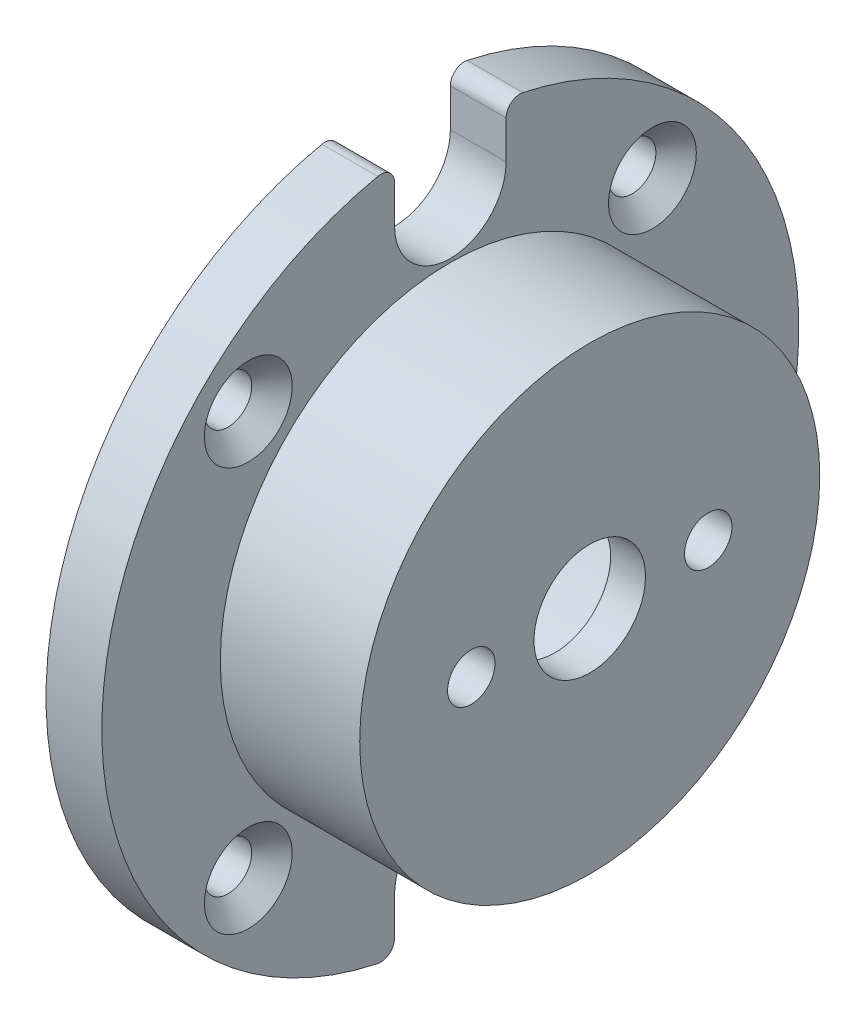
ISO-10303-21;
HEADER;
FILE_DESCRIPTION(('STEP AP214'),'2;1');
FILE_NAME('part.step','',(''),(''),'','','');
FILE_SCHEMA(('AUTOMOTIVE_DESIGN { 1 0 10303 214 1 1 1 1 }'));
ENDSEC;
DATA;
#1=APPLICATION_CONTEXT('core data for automotive mechanical design processes');
#2=APPLICATION_PROTOCOL_DEFINITION('international standard','automotive_design',2000,#1);
#3=PRODUCT_CONTEXT('',#1,'mechanical');
#4=PRODUCT('Part','Part','',(#3));
#5=PRODUCT_RELATED_PRODUCT_CATEGORY('part','',(#4));
#6=PRODUCT_DEFINITION_FORMATION('','',#4);
#7=PRODUCT_DEFINITION_CONTEXT('part definition',#1,'design');
#8=PRODUCT_DEFINITION('design','',#6,#7);
#9=PRODUCT_DEFINITION_SHAPE('','',#8);
#10=(LENGTH_UNIT() NAMED_UNIT(*) SI_UNIT(.MILLI.,.METRE.));
#11=(NAMED_UNIT(*) PLANE_ANGLE_UNIT() SI_UNIT($,.RADIAN.));
#12=(NAMED_UNIT(*) SI_UNIT($,.STERADIAN.) SOLID_ANGLE_UNIT());
#13=UNCERTAINTY_MEASURE_WITH_UNIT(LENGTH_MEASURE(1.E-05),#10,'distance_accuracy_value','');
#14=(GEOMETRIC_REPRESENTATION_CONTEXT(3) GLOBAL_UNCERTAINTY_ASSIGNED_CONTEXT((#13)) GLOBAL_UNIT_ASSIGNED_CONTEXT((#10,
#11,#12)) REPRESENTATION_CONTEXT('',''));
#15=CARTESIAN_POINT('',(0.,0.,0.));
#16=DIRECTION('',(0.,0.,1.));
#17=DIRECTION('',(1.,0.,0.));
#18=AXIS2_PLACEMENT_3D('',#15,#16,#17);
#19=CARTESIAN_POINT('',(4.,0.,0.));
#20=DIRECTION('',(-1.,0.,0.));
#21=DIRECTION('',(0.,0.,1.));
#22=AXIS2_PLACEMENT_3D('',#19,#20,#21);
#23=CYLINDRICAL_SURFACE('',#22,25.);
#24=DIRECTION('',(1.,0.,0.));
#25=VECTOR('',#24,1.);
#26=CARTESIAN_POINT('',(-6.,-24.4514470714698,-5.20833333333333));
#27=LINE('',#26,#25);
#28=CARTESIAN_POINT('',(0.,-24.4514470714698,-5.20833333333333));
#29=VERTEX_POINT('',#28);
#30=CARTESIAN_POINT('',(4.,-24.4514470714698,-5.20833333333333));
#31=VERTEX_POINT('',#30);
#32=EDGE_CURVE('E146',#29,#31,#27,.T.);
#33=ORIENTED_EDGE('',*,*,#32,.F.);
#34=CARTESIAN_POINT('',(0.,0.,0.));
#35=DIRECTION('',(1.,0.,0.));
#36=DIRECTION('',(0.,0.,-1.));
#37=AXIS2_PLACEMENT_3D('',#34,#35,#36);
#38=CIRCLE('',#37,25.);
#39=CARTESIAN_POINT('',(0.,24.4514470714698,-5.20833333333334));
#40=VERTEX_POINT('',#39);
#41=EDGE_CURVE('E165',#29,#40,#38,.T.);
#42=ORIENTED_EDGE('',*,*,#41,.T.);
#43=DIRECTION('',(1.,0.,0.));
#44=VECTOR('',#43,1.);
#45=CARTESIAN_POINT('',(-6.,24.4514470714698,-5.20833333333334));
#46=LINE('',#45,#44);
#47=CARTESIAN_POINT('',(4.,24.4514470714698,-5.20833333333334));
#48=VERTEX_POINT('',#47);
#49=EDGE_CURVE('E231',#40,#48,#46,.T.);
#50=ORIENTED_EDGE('',*,*,#49,.T.);
#51=CARTESIAN_POINT('',(4.,0.,0.));
#52=DIRECTION('',(1.,0.,0.));
#53=DIRECTION('',(0.,0.,-1.));
#54=AXIS2_PLACEMENT_3D('',#51,#52,#53);
#55=CIRCLE('',#54,25.);
#56=EDGE_CURVE('E155',#31,#48,#55,.T.);
#57=ORIENTED_EDGE('',*,*,#56,.F.);
#58=EDGE_LOOP('',(#33,#42,#50,#57));
#59=FACE_BOUND('',#58,.T.);
#60=ADVANCED_FACE('F39',(#59),#23,.T.);
#61=CARTESIAN_POINT('',(4.,0.,0.));
#62=DIRECTION('',(1.,0.,0.));
#63=DIRECTION('',(0.,0.,-1.));
#64=AXIS2_PLACEMENT_3D('',#61,#62,#63);
#65=PLANE('',#64);
#66=CARTESIAN_POINT('',(4.,-23.473389188611,5.));
#67=DIRECTION('',(-1.,0.,0.));
#68=DIRECTION('',(0.,0.,1.));
#69=AXIS2_PLACEMENT_3D('',#66,#67,#68);
#70=CIRCLE('',#69,1.);
#71=CARTESIAN_POINT('',(4.,-23.473389188611,4.));
#72=VERTEX_POINT('',#71);
#73=CARTESIAN_POINT('',(4.,-24.4514470714698,5.20833333333333));
#74=VERTEX_POINT('',#73);
#75=EDGE_CURVE('E127',#72,#74,#70,.T.);
#76=ORIENTED_EDGE('',*,*,#75,.F.);
#77=DIRECTION('',(0.,-1.,0.));
#78=VECTOR('',#77,1.);
#79=CARTESIAN_POINT('',(4.,-20.75,4.));
#80=LINE('',#79,#78);
#81=CARTESIAN_POINT('',(4.,-20.75,4.));
#82=VERTEX_POINT('',#81);
#83=EDGE_CURVE('E147',#82,#72,#80,.T.);
#84=ORIENTED_EDGE('',*,*,#83,.F.);
#85=CARTESIAN_POINT('',(4.,-20.75,0.));
#86=DIRECTION('',(1.,0.,0.));
#87=DIRECTION('',(0.,0.,1.));
#88=AXIS2_PLACEMENT_3D('',#85,#86,#87);
#89=CIRCLE('',#88,4.);
#90=CARTESIAN_POINT('',(4.,-20.75,-4.));
#91=VERTEX_POINT('',#90);
#92=EDGE_CURVE('E209',#91,#82,#89,.T.);
#93=ORIENTED_EDGE('',*,*,#92,.F.);
#94=DIRECTION('',(0.,1.,0.));
#95=VECTOR('',#94,1.);
#96=CARTESIAN_POINT('',(4.,-20.75,-4.));
#97=LINE('',#96,#95);
#98=CARTESIAN_POINT('',(4.,-23.473389188611,-4.));
#99=VERTEX_POINT('',#98);
#100=EDGE_CURVE('E560',#99,#91,#97,.T.);
#101=ORIENTED_EDGE('',*,*,#100,.F.);
#102=CARTESIAN_POINT('',(4.,-23.473389188611,-5.));
#103=DIRECTION('',(-1.,0.,0.));
#104=DIRECTION('',(0.,0.,-1.));
#105=AXIS2_PLACEMENT_3D('',#102,#103,#104);
#106=CIRCLE('',#105,1.);
#107=EDGE_CURVE('E137',#31,#99,#106,.T.);
#108=ORIENTED_EDGE('',*,*,#107,.F.);
#109=ORIENTED_EDGE('',*,*,#56,.T.);
#110=CARTESIAN_POINT('',(4.,23.473389188611,-5.));
#111=DIRECTION('',(-1.,0.,0.));
#112=DIRECTION('',(0.,0.,1.));
#113=AXIS2_PLACEMENT_3D('',#110,#111,#112);
#114=CIRCLE('',#113,1.);
#115=CARTESIAN_POINT('',(4.,23.473389188611,-4.));
#116=VERTEX_POINT('',#115);
#117=EDGE_CURVE('E212',#116,#48,#114,.T.);
#118=ORIENTED_EDGE('',*,*,#117,.F.);
#119=DIRECTION('',(0.,1.,0.));
#120=VECTOR('',#119,1.);
#121=CARTESIAN_POINT('',(4.,20.75,-4.));
#122=LINE('',#121,#120);
#123=CARTESIAN_POINT('',(4.,20.75,-4.));
#124=VERTEX_POINT('',#123);
#125=EDGE_CURVE('E228',#124,#116,#122,.T.);
#126=ORIENTED_EDGE('',*,*,#125,.F.);
#127=CARTESIAN_POINT('',(4.,20.75,0.));
#128=DIRECTION('',(1.,0.,0.));
#129=DIRECTION('',(0.,0.,-1.));
#130=AXIS2_PLACEMENT_3D('',#127,#128,#129);
#131=CIRCLE('',#130,4.);
#132=CARTESIAN_POINT('',(4.,20.75,4.));
#133=VERTEX_POINT('',#132);
#134=EDGE_CURVE('E225',#133,#124,#131,.T.);
#135=ORIENTED_EDGE('',*,*,#134,.F.);
#136=DIRECTION('',(0.,-1.,0.));
#137=VECTOR('',#136,1.);
#138=CARTESIAN_POINT('',(4.,20.75,4.));
#139=LINE('',#138,#137);
#140=CARTESIAN_POINT('',(4.,23.473389188611,4.));
#141=VERTEX_POINT('',#140);
#142=EDGE_CURVE('E222',#141,#133,#139,.T.);
#143=ORIENTED_EDGE('',*,*,#142,.F.);
#144=CARTESIAN_POINT('',(4.,23.473389188611,5.));
#145=DIRECTION('',(-1.,0.,0.));
#146=DIRECTION('',(0.,0.,-1.));
#147=AXIS2_PLACEMENT_3D('',#144,#145,#146);
#148=CIRCLE('',#147,1.);
#149=CARTESIAN_POINT('',(4.,24.4514470714698,5.20833333333333));
#150=VERTEX_POINT('',#149);
#151=EDGE_CURVE('E153',#150,#141,#148,.T.);
#152=ORIENTED_EDGE('',*,*,#151,.F.);
#153=EDGE_CURVE('E143',#150,#74,#55,.T.);
#154=ORIENTED_EDGE('',*,*,#153,.T.);
#155=EDGE_LOOP('',(#76,#84,#93,#101,#108,#109,#118,#126,#135,#143,#152,#154));
#156=FACE_BOUND('',#155,.T.);
#157=CARTESIAN_POINT('',(4.,14.4956890143241,14.4956890143244));
#158=DIRECTION('',(1.,0.,0.));
#159=DIRECTION('',(0.,0.,-1.));
#160=AXIS2_PLACEMENT_3D('',#157,#158,#159);
#161=CIRCLE('',#160,3.15);
#162=CARTESIAN_POINT('',(4.,14.4956890143241,11.3456890143244));
#163=VERTEX_POINT('',#162);
#164=EDGE_CURVE('E249',#163,#163,#161,.T.);
#165=ORIENTED_EDGE('',*,*,#164,.F.);
#166=EDGE_LOOP('',(#165));
#167=FACE_BOUND('',#166,.T.);
#168=CARTESIAN_POINT('',(4.,14.4956890143242,-14.4956890143242));
#169=DIRECTION('',(1.,0.,0.));
#170=DIRECTION('',(0.,0.,-1.));
#171=AXIS2_PLACEMENT_3D('',#168,#169,#170);
#172=CIRCLE('',#171,3.15);
#173=CARTESIAN_POINT('',(4.,14.4956890143242,-17.6456890143242));
#174=VERTEX_POINT('',#173);
#175=EDGE_CURVE('E258',#174,#174,#172,.T.);
#176=ORIENTED_EDGE('',*,*,#175,.F.);
#177=EDGE_LOOP('',(#176));
#178=FACE_BOUND('',#177,.T.);
#179=CARTESIAN_POINT('',(4.,-14.4956890143242,-14.4956890143243));
#180=DIRECTION('',(1.,0.,0.));
#181=DIRECTION('',(0.,0.,-1.));
#182=AXIS2_PLACEMENT_3D('',#179,#180,#181);
#183=CIRCLE('',#182,3.15);
#184=CARTESIAN_POINT('',(4.,-14.4956890143242,-17.6456890143243));
#185=VERTEX_POINT('',#184);
#186=EDGE_CURVE('E267',#185,#185,#183,.T.);
#187=ORIENTED_EDGE('',*,*,#186,.F.);
#188=EDGE_LOOP('',(#187));
#189=FACE_BOUND('',#188,.T.);
#190=CARTESIAN_POINT('',(4.,-14.4956890143242,14.4956890143242));
#191=DIRECTION('',(1.,0.,0.));
#192=DIRECTION('',(0.,0.,-1.));
#193=AXIS2_PLACEMENT_3D('',#190,#191,#192);
#194=CIRCLE('',#193,3.15);
#195=CARTESIAN_POINT('',(4.,-14.4956890143242,11.3456890143242));
#196=VERTEX_POINT('',#195);
#197=EDGE_CURVE('E276',#196,#196,#194,.T.);
#198=ORIENTED_EDGE('',*,*,#197,.F.);
#199=EDGE_LOOP('',(#198));
#200=FACE_BOUND('',#199,.T.);
#201=CARTESIAN_POINT('',(4.,0.,0.));
#202=DIRECTION('',(1.,0.,0.));
#203=DIRECTION('',(0.,0.,-1.));
#204=AXIS2_PLACEMENT_3D('',#201,#202,#203);
#205=CIRCLE('',#204,16.5);
#206=CARTESIAN_POINT('',(4.,0.,-16.5));
#207=VERTEX_POINT('',#206);
#208=EDGE_CURVE('E162',#207,#207,#205,.T.);
#209=ORIENTED_EDGE('',*,*,#208,.F.);
#210=EDGE_LOOP('',(#209));
#211=FACE_BOUND('',#210,.T.);
#212=ADVANCED_FACE('F150',(#156,#167,#178,#189,#200,#211),#65,.T.);
#213=CARTESIAN_POINT('',(0.,24.4514470714698,5.20833333333333));
#214=VERTEX_POINT('',#213);
#215=CARTESIAN_POINT('',(0.,-24.4514470714698,5.20833333333333));
#216=VERTEX_POINT('',#215);
#217=EDGE_CURVE('E145',#214,#216,#38,.T.);
#218=ORIENTED_EDGE('',*,*,#217,.T.);
#219=DIRECTION('',(1.,0.,0.));
#220=VECTOR('',#219,1.);
#221=CARTESIAN_POINT('',(-6.,-24.4514470714698,5.20833333333333));
#222=LINE('',#221,#220);
#223=EDGE_CURVE('E130',#216,#74,#222,.T.);
#224=ORIENTED_EDGE('',*,*,#223,.T.);
#225=ORIENTED_EDGE('',*,*,#153,.F.);
#226=DIRECTION('',(1.,0.,0.));
#227=VECTOR('',#226,1.);
#228=CARTESIAN_POINT('',(-6.,24.4514470714698,5.20833333333333));
#229=LINE('',#228,#227);
#230=EDGE_CURVE('E240',#214,#150,#229,.T.);
#231=ORIENTED_EDGE('',*,*,#230,.F.);
#232=EDGE_LOOP('',(#218,#224,#225,#231));
#233=FACE_BOUND('',#232,.T.);
#234=ADVANCED_FACE('F41',(#233),#23,.T.);
#235=CARTESIAN_POINT('',(0.,0.,0.));
#236=DIRECTION('',(1.,0.,0.));
#237=DIRECTION('',(0.,0.,-1.));
#238=AXIS2_PLACEMENT_3D('',#235,#236,#237);
#239=PLANE('',#238);
#240=CARTESIAN_POINT('',(0.,0.,0.));
#241=DIRECTION('',(-1.,0.,0.));
#242=DIRECTION('',(0.,0.,1.));
#243=AXIS2_PLACEMENT_3D('',#240,#241,#242);
#244=CIRCLE('',#243,13.125);
#245=CARTESIAN_POINT('',(0.,0.,13.125));
#246=VERTEX_POINT('',#245);
#247=EDGE_CURVE('E234',#246,#246,#244,.T.);
#248=ORIENTED_EDGE('',*,*,#247,.F.);
#249=EDGE_LOOP('',(#248));
#250=FACE_BOUND('',#249,.T.);
#251=CARTESIAN_POINT('',(0.,14.4956890143241,14.4956890143244));
#252=DIRECTION('',(1.,0.,0.));
#253=DIRECTION('',(0.,0.,-1.));
#254=AXIS2_PLACEMENT_3D('',#251,#252,#253);
#255=CIRCLE('',#254,1.7);
#256=CARTESIAN_POINT('',(0.,14.4956890143241,12.7956890143244));
#257=VERTEX_POINT('',#256);
#258=EDGE_CURVE('E255',#257,#257,#255,.T.);
#259=ORIENTED_EDGE('',*,*,#258,.T.);
#260=EDGE_LOOP('',(#259));
#261=FACE_BOUND('',#260,.T.);
#262=CARTESIAN_POINT('',(0.,14.4956890143242,-14.4956890143242));
#263=DIRECTION('',(1.,0.,0.));
#264=DIRECTION('',(0.,0.,-1.));
#265=AXIS2_PLACEMENT_3D('',#262,#263,#264);
#266=CIRCLE('',#265,1.7);
#267=CARTESIAN_POINT('',(0.,14.4956890143242,-16.1956890143242));
#268=VERTEX_POINT('',#267);
#269=EDGE_CURVE('E264',#268,#268,#266,.T.);
#270=ORIENTED_EDGE('',*,*,#269,.T.);
#271=EDGE_LOOP('',(#270));
#272=FACE_BOUND('',#271,.T.);
#273=CARTESIAN_POINT('',(0.,-14.4956890143242,-14.4956890143243));
#274=DIRECTION('',(1.,0.,0.));
#275=DIRECTION('',(0.,0.,-1.));
#276=AXIS2_PLACEMENT_3D('',#273,#274,#275);
#277=CIRCLE('',#276,1.7);
#278=CARTESIAN_POINT('',(0.,-14.4956890143242,-16.1956890143243));
#279=VERTEX_POINT('',#278);
#280=EDGE_CURVE('E273',#279,#279,#277,.T.);
#281=ORIENTED_EDGE('',*,*,#280,.T.);
#282=EDGE_LOOP('',(#281));
#283=FACE_BOUND('',#282,.T.);
#284=CARTESIAN_POINT('',(0.,-14.4956890143242,14.4956890143242));
#285=DIRECTION('',(1.,0.,0.));
#286=DIRECTION('',(0.,0.,-1.));
#287=AXIS2_PLACEMENT_3D('',#284,#285,#286);
#288=CIRCLE('',#287,1.7);
#289=CARTESIAN_POINT('',(0.,-14.4956890143242,12.7956890143242));
#290=VERTEX_POINT('',#289);
#291=EDGE_CURVE('E282',#290,#290,#288,.T.);
#292=ORIENTED_EDGE('',*,*,#291,.T.);
#293=EDGE_LOOP('',(#292));
#294=FACE_BOUND('',#293,.T.);
#295=DIRECTION('',(0.,-1.,0.));
#296=VECTOR('',#295,1.);
#297=CARTESIAN_POINT('',(0.,0.,4.));
#298=LINE('',#297,#296);
#299=CARTESIAN_POINT('',(0.,-20.75,4.));
#300=VERTEX_POINT('',#299);
#301=CARTESIAN_POINT('',(0.,-23.473389188611,4.));
#302=VERTEX_POINT('',#301);
#303=EDGE_CURVE('E47',#300,#302,#298,.T.);
#304=ORIENTED_EDGE('',*,*,#303,.T.);
#305=CARTESIAN_POINT('',(0.,-23.473389188611,5.));
#306=DIRECTION('',(1.,0.,0.));
#307=DIRECTION('',(0.,0.,-1.));
#308=AXIS2_PLACEMENT_3D('',#305,#306,#307);
#309=CIRCLE('',#308,1.);
#310=EDGE_CURVE('E12',#302,#216,#309,.F.);
#311=ORIENTED_EDGE('',*,*,#310,.T.);
#312=ORIENTED_EDGE('',*,*,#217,.F.);
#313=CARTESIAN_POINT('',(0.,23.473389188611,5.));
#314=DIRECTION('',(1.,0.,0.));
#315=DIRECTION('',(0.,0.,-1.));
#316=AXIS2_PLACEMENT_3D('',#313,#314,#315);
#317=CIRCLE('',#316,1.);
#318=CARTESIAN_POINT('',(0.,23.473389188611,4.));
#319=VERTEX_POINT('',#318);
#320=EDGE_CURVE('E154',#214,#319,#317,.F.);
#321=ORIENTED_EDGE('',*,*,#320,.T.);
#322=DIRECTION('',(0.,-1.,0.));
#323=VECTOR('',#322,1.);
#324=CARTESIAN_POINT('',(0.,0.,4.));
#325=LINE('',#324,#323);
#326=CARTESIAN_POINT('',(0.,20.75,4.));
#327=VERTEX_POINT('',#326);
#328=EDGE_CURVE('E158',#319,#327,#325,.T.);
#329=ORIENTED_EDGE('',*,*,#328,.T.);
#330=CARTESIAN_POINT('',(0.,20.75,0.));
#331=DIRECTION('',(1.,0.,0.));
#332=DIRECTION('',(0.,0.,-1.));
#333=AXIS2_PLACEMENT_3D('',#330,#331,#332);
#334=CIRCLE('',#333,4.);
#335=CARTESIAN_POINT('',(0.,20.75,-4.));
#336=VERTEX_POINT('',#335);
#337=EDGE_CURVE('E180',#327,#336,#334,.T.);
#338=ORIENTED_EDGE('',*,*,#337,.T.);
#339=DIRECTION('',(0.,1.,0.));
#340=VECTOR('',#339,1.);
#341=CARTESIAN_POINT('',(0.,0.,-4.));
#342=LINE('',#341,#340);
#343=CARTESIAN_POINT('',(0.,23.473389188611,-4.));
#344=VERTEX_POINT('',#343);
#345=EDGE_CURVE('E183',#336,#344,#342,.T.);
#346=ORIENTED_EDGE('',*,*,#345,.T.);
#347=CARTESIAN_POINT('',(0.,23.473389188611,-5.));
#348=DIRECTION('',(1.,0.,0.));
#349=DIRECTION('',(0.,0.,-1.));
#350=AXIS2_PLACEMENT_3D('',#347,#348,#349);
#351=CIRCLE('',#350,1.);
#352=EDGE_CURVE('E186',#344,#40,#351,.F.);
#353=ORIENTED_EDGE('',*,*,#352,.T.);
#354=ORIENTED_EDGE('',*,*,#41,.F.);
#355=CARTESIAN_POINT('',(0.,-23.473389188611,-5.));
#356=DIRECTION('',(1.,0.,0.));
#357=DIRECTION('',(0.,0.,-1.));
#358=AXIS2_PLACEMENT_3D('',#355,#356,#357);
#359=CIRCLE('',#358,1.);
#360=CARTESIAN_POINT('',(0.,-23.473389188611,-4.));
#361=VERTEX_POINT('',#360);
#362=EDGE_CURVE('E189',#29,#361,#359,.F.);
#363=ORIENTED_EDGE('',*,*,#362,.T.);
#364=DIRECTION('',(0.,1.,0.));
#365=VECTOR('',#364,1.);
#366=CARTESIAN_POINT('',(0.,0.,-4.));
#367=LINE('',#366,#365);
#368=CARTESIAN_POINT('',(0.,-20.75,-4.));
#369=VERTEX_POINT('',#368);
#370=EDGE_CURVE('E192',#361,#369,#367,.T.);
#371=ORIENTED_EDGE('',*,*,#370,.T.);
#372=CARTESIAN_POINT('',(0.,-20.75,0.));
#373=DIRECTION('',(1.,0.,0.));
#374=DIRECTION('',(0.,0.,-1.));
#375=AXIS2_PLACEMENT_3D('',#372,#373,#374);
#376=CIRCLE('',#375,4.);
#377=EDGE_CURVE('E195',#369,#300,#376,.T.);
#378=ORIENTED_EDGE('',*,*,#377,.T.);
#379=EDGE_LOOP('',(#304,#311,#312,#321,#329,#338,#346,#353,#354,#363,#371,#378));
#380=FACE_BOUND('',#379,.T.);
#381=ADVANCED_FACE('F199',(#250,#261,#272,#283,#294,#380),#239,.F.);
#382=CARTESIAN_POINT('',(14.,0.,0.));
#383=DIRECTION('',(-1.,0.,0.));
#384=DIRECTION('',(0.,0.,1.));
#385=AXIS2_PLACEMENT_3D('',#382,#383,#384);
#386=CYLINDRICAL_SURFACE('',#385,16.5);
#387=CARTESIAN_POINT('',(14.,0.,0.));
#388=DIRECTION('',(1.,0.,0.));
#389=DIRECTION('',(0.,0.,-1.));
#390=AXIS2_PLACEMENT_3D('',#387,#388,#389);
#391=CIRCLE('',#390,16.5);
#392=CARTESIAN_POINT('',(14.,0.,-16.5));
#393=VERTEX_POINT('',#392);
#394=EDGE_CURVE('E290',#393,#393,#391,.T.);
#395=ORIENTED_EDGE('',*,*,#394,.F.);
#396=EDGE_LOOP('',(#395));
#397=FACE_BOUND('',#396,.T.);
#398=ORIENTED_EDGE('',*,*,#208,.T.);
#399=EDGE_LOOP('',(#398));
#400=FACE_BOUND('',#399,.T.);
#401=ADVANCED_FACE('F297',(#397,#400),#386,.T.);
#402=CARTESIAN_POINT('',(14.,0.,0.));
#403=DIRECTION('',(1.,0.,0.));
#404=DIRECTION('',(0.,0.,-1.));
#405=AXIS2_PLACEMENT_3D('',#402,#403,#404);
#406=PLANE('',#405);
#407=CARTESIAN_POINT('',(14.,0.,-8.5));
#408=DIRECTION('',(1.,0.,0.));
#409=DIRECTION('',(0.,0.,-1.));
#410=AXIS2_PLACEMENT_3D('',#407,#408,#409);
#411=CIRCLE('',#410,1.69999999999999);
#412=CARTESIAN_POINT('',(14.,0.,-10.2));
#413=VERTEX_POINT('',#412);
#414=EDGE_CURVE('E176',#413,#413,#411,.T.);
#415=ORIENTED_EDGE('',*,*,#414,.F.);
#416=EDGE_LOOP('',(#415));
#417=FACE_BOUND('',#416,.T.);
#418=CARTESIAN_POINT('',(14.,0.,8.5));
#419=DIRECTION('',(1.,0.,0.));
#420=DIRECTION('',(0.,0.,-1.));
#421=AXIS2_PLACEMENT_3D('',#418,#419,#420);
#422=CIRCLE('',#421,1.69999999999999);
#423=CARTESIAN_POINT('',(14.,0.,6.80000000000001));
#424=VERTEX_POINT('',#423);
#425=EDGE_CURVE('E173',#424,#424,#422,.T.);
#426=ORIENTED_EDGE('',*,*,#425,.F.);
#427=EDGE_LOOP('',(#426));
#428=FACE_BOUND('',#427,.T.);
#429=CARTESIAN_POINT('',(14.,0.,0.));
#430=DIRECTION('',(1.,0.,0.));
#431=DIRECTION('',(0.,0.,-1.));
#432=AXIS2_PLACEMENT_3D('',#429,#430,#431);
#433=CIRCLE('',#432,4.);
#434=CARTESIAN_POINT('',(14.,0.,-4.));
#435=VERTEX_POINT('',#434);
#436=EDGE_CURVE('E169',#435,#435,#433,.T.);
#437=ORIENTED_EDGE('',*,*,#436,.F.);
#438=EDGE_LOOP('',(#437));
#439=FACE_BOUND('',#438,.T.);
#440=ORIENTED_EDGE('',*,*,#394,.T.);
#441=EDGE_LOOP('',(#440));
#442=FACE_BOUND('',#441,.T.);
#443=ADVANCED_FACE('F313',(#417,#428,#439,#442),#406,.T.);
#444=CARTESIAN_POINT('',(11.5,0.,0.));
#445=DIRECTION('',(1.,0.,0.));
#446=DIRECTION('',(0.,0.,-1.));
#447=AXIS2_PLACEMENT_3D('',#444,#445,#446);
#448=PLANE('',#447);
#449=CARTESIAN_POINT('',(11.5,0.,-8.5));
#450=DIRECTION('',(1.,0.,0.));
#451=DIRECTION('',(0.,0.,-1.));
#452=AXIS2_PLACEMENT_3D('',#449,#450,#451);
#453=CIRCLE('',#452,1.69999999999999);
#454=CARTESIAN_POINT('',(11.5,0.,-10.2));
#455=VERTEX_POINT('',#454);
#456=EDGE_CURVE('E174',#455,#455,#453,.T.);
#457=ORIENTED_EDGE('',*,*,#456,.T.);
#458=EDGE_LOOP('',(#457));
#459=FACE_BOUND('',#458,.T.);
#460=CARTESIAN_POINT('',(11.5,0.,8.5));
#461=DIRECTION('',(1.,0.,0.));
#462=DIRECTION('',(0.,0.,-1.));
#463=AXIS2_PLACEMENT_3D('',#460,#461,#462);
#464=CIRCLE('',#463,1.69999999999999);
#465=CARTESIAN_POINT('',(11.5,0.,6.80000000000001));
#466=VERTEX_POINT('',#465);
#467=EDGE_CURVE('E170',#466,#466,#464,.T.);
#468=ORIENTED_EDGE('',*,*,#467,.T.);
#469=EDGE_LOOP('',(#468));
#470=FACE_BOUND('',#469,.T.);
#471=CARTESIAN_POINT('',(11.5,0.,0.));
#472=DIRECTION('',(1.,0.,0.));
#473=DIRECTION('',(0.,0.,-1.));
#474=AXIS2_PLACEMENT_3D('',#471,#472,#473);
#475=CIRCLE('',#474,4.);
#476=CARTESIAN_POINT('',(11.5,0.,-4.));
#477=VERTEX_POINT('',#476);
#478=EDGE_CURVE('E166',#477,#477,#475,.T.);
#479=ORIENTED_EDGE('',*,*,#478,.T.);
#480=EDGE_LOOP('',(#479));
#481=FACE_BOUND('',#480,.T.);
#482=CARTESIAN_POINT('',(11.5,0.,0.));
#483=DIRECTION('',(1.,0.,0.));
#484=DIRECTION('',(0.,0.,-1.));
#485=AXIS2_PLACEMENT_3D('',#482,#483,#484);
#486=CIRCLE('',#485,13.125);
#487=CARTESIAN_POINT('',(11.5,0.,-13.125));
#488=VERTEX_POINT('',#487);
#489=EDGE_CURVE('E246',#488,#488,#486,.F.);
#490=ORIENTED_EDGE('',*,*,#489,.T.);
#491=EDGE_LOOP('',(#490));
#492=FACE_BOUND('',#491,.T.);
#493=ADVANCED_FACE('F357',(#459,#470,#481,#492),#448,.F.);
#494=CARTESIAN_POINT('',(10.,0.,0.));
#495=DIRECTION('',(1.,0.,0.));
#496=DIRECTION('',(0.,0.,-1.));
#497=AXIS2_PLACEMENT_3D('',#494,#495,#496);
#498=CYLINDRICAL_SURFACE('',#497,4.);
#499=ORIENTED_EDGE('',*,*,#436,.T.);
#500=EDGE_LOOP('',(#499));
#501=FACE_BOUND('',#500,.T.);
#502=ORIENTED_EDGE('',*,*,#478,.F.);
#503=EDGE_LOOP('',(#502));
#504=FACE_BOUND('',#503,.T.);
#505=ADVANCED_FACE('F353',(#501,#504),#498,.F.);
#506=CARTESIAN_POINT('',(14.,0.,8.5));
#507=DIRECTION('',(1.,0.,0.));
#508=DIRECTION('',(0.,0.,-1.));
#509=AXIS2_PLACEMENT_3D('',#506,#507,#508);
#510=CYLINDRICAL_SURFACE('',#509,1.69999999999999);
#511=ORIENTED_EDGE('',*,*,#425,.T.);
#512=EDGE_LOOP('',(#511));
#513=FACE_BOUND('',#512,.T.);
#514=ORIENTED_EDGE('',*,*,#467,.F.);
#515=EDGE_LOOP('',(#514));
#516=FACE_BOUND('',#515,.T.);
#517=ADVANCED_FACE('F349',(#513,#516),#510,.F.);
#518=CARTESIAN_POINT('',(14.,0.,-8.5));
#519=DIRECTION('',(1.,0.,0.));
#520=DIRECTION('',(0.,0.,-1.));
#521=AXIS2_PLACEMENT_3D('',#518,#519,#520);
#522=CYLINDRICAL_SURFACE('',#521,1.69999999999999);
#523=ORIENTED_EDGE('',*,*,#414,.T.);
#524=EDGE_LOOP('',(#523));
#525=FACE_BOUND('',#524,.T.);
#526=ORIENTED_EDGE('',*,*,#456,.F.);
#527=EDGE_LOOP('',(#526));
#528=FACE_BOUND('',#527,.T.);
#529=ADVANCED_FACE('F329',(#525,#528),#522,.F.);
#530=CARTESIAN_POINT('',(4.,-14.4956890143242,14.4956890143242));
#531=DIRECTION('',(1.,0.,0.));
#532=DIRECTION('',(0.,0.,-1.));
#533=AXIS2_PLACEMENT_3D('',#530,#531,#532);
#534=CYLINDRICAL_SURFACE('',#533,1.7);
#535=ORIENTED_EDGE('',*,*,#291,.F.);
#536=EDGE_LOOP('',(#535));
#537=FACE_BOUND('',#536,.T.);
#538=CARTESIAN_POINT('',(2.55,-14.4956890143242,14.4956890143242));
#539=DIRECTION('',(1.,0.,0.));
#540=DIRECTION('',(0.,0.,-1.));
#541=AXIS2_PLACEMENT_3D('',#538,#539,#540);
#542=CIRCLE('',#541,1.7);
#543=CARTESIAN_POINT('',(2.55,-14.4956890143242,12.7956890143242));
#544=VERTEX_POINT('',#543);
#545=EDGE_CURVE('E279',#544,#544,#542,.T.);
#546=ORIENTED_EDGE('',*,*,#545,.T.);
#547=EDGE_LOOP('',(#546));
#548=FACE_BOUND('',#547,.T.);
#549=ADVANCED_FACE('F325',(#537,#548),#534,.F.);
#550=CARTESIAN_POINT('',(4.,-14.4956890143242,14.4956890143242));
#551=DIRECTION('',(1.,0.,0.));
#552=DIRECTION('',(0.,0.,-1.));
#553=AXIS2_PLACEMENT_3D('',#550,#551,#552);
#554=CONICAL_SURFACE('',#553,3.15,0.785398163397449);
#555=ORIENTED_EDGE('',*,*,#545,.F.);
#556=EDGE_LOOP('',(#555));
#557=FACE_BOUND('',#556,.T.);
#558=ORIENTED_EDGE('',*,*,#197,.T.);
#559=EDGE_LOOP('',(#558));
#560=FACE_BOUND('',#559,.T.);
#561=ADVANCED_FACE('F328',(#557,#560),#554,.F.);
#562=CARTESIAN_POINT('',(4.,-14.4956890143242,-14.4956890143243));
#563=DIRECTION('',(1.,0.,0.));
#564=DIRECTION('',(0.,0.,-1.));
#565=AXIS2_PLACEMENT_3D('',#562,#563,#564);
#566=CYLINDRICAL_SURFACE('',#565,1.7);
#567=ORIENTED_EDGE('',*,*,#280,.F.);
#568=EDGE_LOOP('',(#567));
#569=FACE_BOUND('',#568,.T.);
#570=CARTESIAN_POINT('',(2.55,-14.4956890143242,-14.4956890143243));
#571=DIRECTION('',(1.,0.,0.));
#572=DIRECTION('',(0.,0.,-1.));
#573=AXIS2_PLACEMENT_3D('',#570,#571,#572);
#574=CIRCLE('',#573,1.7);
#575=CARTESIAN_POINT('',(2.55,-14.4956890143242,-16.1956890143243));
#576=VERTEX_POINT('',#575);
#577=EDGE_CURVE('E270',#576,#576,#574,.T.);
#578=ORIENTED_EDGE('',*,*,#577,.T.);
#579=EDGE_LOOP('',(#578));
#580=FACE_BOUND('',#579,.T.);
#581=ADVANCED_FACE('F335',(#569,#580),#566,.F.);
#582=CARTESIAN_POINT('',(4.,-14.4956890143242,-14.4956890143243));
#583=DIRECTION('',(1.,0.,0.));
#584=DIRECTION('',(0.,0.,-1.));
#585=AXIS2_PLACEMENT_3D('',#582,#583,#584);
#586=CONICAL_SURFACE('',#585,3.15,0.785398163397448);
#587=ORIENTED_EDGE('',*,*,#577,.F.);
#588=EDGE_LOOP('',(#587));
#589=FACE_BOUND('',#588,.T.);
#590=ORIENTED_EDGE('',*,*,#186,.T.);
#591=EDGE_LOOP('',(#590));
#592=FACE_BOUND('',#591,.T.);
#593=ADVANCED_FACE('F342',(#589,#592),#586,.F.);
#594=CARTESIAN_POINT('',(4.,14.4956890143242,-14.4956890143242));
#595=DIRECTION('',(1.,0.,0.));
#596=DIRECTION('',(0.,0.,-1.));
#597=AXIS2_PLACEMENT_3D('',#594,#595,#596);
#598=CYLINDRICAL_SURFACE('',#597,1.7);
#599=ORIENTED_EDGE('',*,*,#269,.F.);
#600=EDGE_LOOP('',(#599));
#601=FACE_BOUND('',#600,.T.);
#602=CARTESIAN_POINT('',(2.55,14.4956890143242,-14.4956890143242));
#603=DIRECTION('',(1.,0.,0.));
#604=DIRECTION('',(0.,0.,-1.));
#605=AXIS2_PLACEMENT_3D('',#602,#603,#604);
#606=CIRCLE('',#605,1.7);
#607=CARTESIAN_POINT('',(2.55,14.4956890143242,-16.1956890143242));
#608=VERTEX_POINT('',#607);
#609=EDGE_CURVE('E261',#608,#608,#606,.T.);
#610=ORIENTED_EDGE('',*,*,#609,.T.);
#611=EDGE_LOOP('',(#610));
#612=FACE_BOUND('',#611,.T.);
#613=ADVANCED_FACE('F400',(#601,#612),#598,.F.);
#614=CARTESIAN_POINT('',(4.,14.4956890143242,-14.4956890143242));
#615=DIRECTION('',(1.,0.,0.));
#616=DIRECTION('',(0.,0.,-1.));
#617=AXIS2_PLACEMENT_3D('',#614,#615,#616);
#618=CONICAL_SURFACE('',#617,3.15,0.785398163397448);
#619=ORIENTED_EDGE('',*,*,#609,.F.);
#620=EDGE_LOOP('',(#619));
#621=FACE_BOUND('',#620,.T.);
#622=ORIENTED_EDGE('',*,*,#175,.T.);
#623=EDGE_LOOP('',(#622));
#624=FACE_BOUND('',#623,.T.);
#625=ADVANCED_FACE('F396',(#621,#624),#618,.F.);
#626=CARTESIAN_POINT('',(4.,14.4956890143241,14.4956890143244));
#627=DIRECTION('',(1.,0.,0.));
#628=DIRECTION('',(0.,0.,-1.));
#629=AXIS2_PLACEMENT_3D('',#626,#627,#628);
#630=CYLINDRICAL_SURFACE('',#629,1.7);
#631=ORIENTED_EDGE('',*,*,#258,.F.);
#632=EDGE_LOOP('',(#631));
#633=FACE_BOUND('',#632,.T.);
#634=CARTESIAN_POINT('',(2.55,14.4956890143241,14.4956890143244));
#635=DIRECTION('',(1.,0.,0.));
#636=DIRECTION('',(0.,0.,-1.));
#637=AXIS2_PLACEMENT_3D('',#634,#635,#636);
#638=CIRCLE('',#637,1.7);
#639=CARTESIAN_POINT('',(2.55,14.4956890143241,12.7956890143244));
#640=VERTEX_POINT('',#639);
#641=EDGE_CURVE('E252',#640,#640,#638,.T.);
#642=ORIENTED_EDGE('',*,*,#641,.T.);
#643=EDGE_LOOP('',(#642));
#644=FACE_BOUND('',#643,.T.);
#645=ADVANCED_FACE('F389',(#633,#644),#630,.F.);
#646=CARTESIAN_POINT('',(4.,14.4956890143241,14.4956890143244));
#647=DIRECTION('',(1.,0.,0.));
#648=DIRECTION('',(0.,0.,-1.));
#649=AXIS2_PLACEMENT_3D('',#646,#647,#648);
#650=CONICAL_SURFACE('',#649,3.15,0.785398163397448);
#651=ORIENTED_EDGE('',*,*,#641,.F.);
#652=EDGE_LOOP('',(#651));
#653=FACE_BOUND('',#652,.T.);
#654=ORIENTED_EDGE('',*,*,#164,.T.);
#655=EDGE_LOOP('',(#654));
#656=FACE_BOUND('',#655,.T.);
#657=ADVANCED_FACE('F379',(#653,#656),#650,.F.);
#658=CARTESIAN_POINT('',(48.6231060122937,0.,0.));
#659=DIRECTION('',(-1.,0.,0.));
#660=DIRECTION('',(0.,0.,1.));
#661=AXIS2_PLACEMENT_3D('',#658,#659,#660);
#662=CYLINDRICAL_SURFACE('',#661,13.125);
#663=ORIENTED_EDGE('',*,*,#247,.T.);
#664=EDGE_LOOP('',(#663));
#665=FACE_BOUND('',#664,.T.);
#666=ORIENTED_EDGE('',*,*,#489,.F.);
#667=EDGE_LOOP('',(#666));
#668=FACE_BOUND('',#667,.T.);
#669=ADVANCED_FACE('F376',(#665,#668),#662,.F.);
#670=CARTESIAN_POINT('',(-6.,23.473389188611,-5.));
#671=DIRECTION('',(1.,0.,0.));
#672=DIRECTION('',(0.,0.,-1.));
#673=AXIS2_PLACEMENT_3D('',#670,#671,#672);
#674=CYLINDRICAL_SURFACE('',#673,1.);
#675=DIRECTION('',(1.,0.,0.));
#676=VECTOR('',#675,1.);
#677=CARTESIAN_POINT('',(-6.,23.473389188611,-4.));
#678=LINE('',#677,#676);
#679=EDGE_CURVE('E232',#344,#116,#678,.T.);
#680=ORIENTED_EDGE('',*,*,#679,.T.);
#681=ORIENTED_EDGE('',*,*,#117,.T.);
#682=ORIENTED_EDGE('',*,*,#49,.F.);
#683=ORIENTED_EDGE('',*,*,#352,.F.);
#684=EDGE_LOOP('',(#680,#681,#682,#683));
#685=FACE_BOUND('',#684,.T.);
#686=ADVANCED_FACE('F378',(#685),#674,.T.);
#687=CARTESIAN_POINT('',(-6.,20.75,-4.));
#688=DIRECTION('',(0.,0.,-1.));
#689=DIRECTION('',(-1.,0.,0.));
#690=AXIS2_PLACEMENT_3D('',#687,#688,#689);
#691=PLANE('',#690);
#692=DIRECTION('',(1.,0.,0.));
#693=VECTOR('',#692,1.);
#694=CARTESIAN_POINT('',(-6.,20.75,-4.));
#695=LINE('',#694,#693);
#696=EDGE_CURVE('E235',#336,#124,#695,.T.);
#697=ORIENTED_EDGE('',*,*,#696,.T.);
#698=ORIENTED_EDGE('',*,*,#125,.T.);
#699=ORIENTED_EDGE('',*,*,#679,.F.);
#700=ORIENTED_EDGE('',*,*,#345,.F.);
#701=EDGE_LOOP('',(#697,#698,#699,#700));
#702=FACE_BOUND('',#701,.T.);
#703=ADVANCED_FACE('F386',(#702),#691,.F.);
#704=CARTESIAN_POINT('',(-6.,20.75,0.));
#705=DIRECTION('',(1.,0.,0.));
#706=DIRECTION('',(0.,0.,-1.));
#707=AXIS2_PLACEMENT_3D('',#704,#705,#706);
#708=CYLINDRICAL_SURFACE('',#707,4.);
#709=DIRECTION('',(1.,0.,0.));
#710=VECTOR('',#709,1.);
#711=CARTESIAN_POINT('',(-6.,20.75,4.));
#712=LINE('',#711,#710);
#713=EDGE_CURVE('E237',#327,#133,#712,.T.);
#714=ORIENTED_EDGE('',*,*,#713,.T.);
#715=ORIENTED_EDGE('',*,*,#134,.T.);
#716=ORIENTED_EDGE('',*,*,#696,.F.);
#717=ORIENTED_EDGE('',*,*,#337,.F.);
#718=EDGE_LOOP('',(#714,#715,#716,#717));
#719=FACE_BOUND('',#718,.T.);
#720=ADVANCED_FACE('F478',(#719),#708,.F.);
#721=CARTESIAN_POINT('',(-6.,20.75,4.));
#722=DIRECTION('',(0.,0.,1.));
#723=DIRECTION('',(1.,0.,0.));
#724=AXIS2_PLACEMENT_3D('',#721,#722,#723);
#725=PLANE('',#724);
#726=DIRECTION('',(1.,0.,0.));
#727=VECTOR('',#726,1.);
#728=CARTESIAN_POINT('',(-6.,23.473389188611,4.));
#729=LINE('',#728,#727);
#730=EDGE_CURVE('E62',#319,#141,#729,.T.);
#731=ORIENTED_EDGE('',*,*,#730,.T.);
#732=ORIENTED_EDGE('',*,*,#142,.T.);
#733=ORIENTED_EDGE('',*,*,#713,.F.);
#734=ORIENTED_EDGE('',*,*,#328,.F.);
#735=EDGE_LOOP('',(#731,#732,#733,#734));
#736=FACE_BOUND('',#735,.T.);
#737=ADVANCED_FACE('F488',(#736),#725,.F.);
#738=CARTESIAN_POINT('',(-6.,23.473389188611,5.));
#739=DIRECTION('',(1.,0.,0.));
#740=DIRECTION('',(0.,0.,-1.));
#741=AXIS2_PLACEMENT_3D('',#738,#739,#740);
#742=CYLINDRICAL_SURFACE('',#741,1.);
#743=ORIENTED_EDGE('',*,*,#230,.T.);
#744=ORIENTED_EDGE('',*,*,#151,.T.);
#745=ORIENTED_EDGE('',*,*,#730,.F.);
#746=ORIENTED_EDGE('',*,*,#320,.F.);
#747=EDGE_LOOP('',(#743,#744,#745,#746));
#748=FACE_BOUND('',#747,.T.);
#749=ADVANCED_FACE('F498',(#748),#742,.T.);
#750=CARTESIAN_POINT('',(-6.,-23.473389188611,5.));
#751=DIRECTION('',(1.,0.,0.));
#752=DIRECTION('',(0.,0.,-1.));
#753=AXIS2_PLACEMENT_3D('',#750,#751,#752);
#754=CYLINDRICAL_SURFACE('',#753,1.);
#755=DIRECTION('',(1.,0.,0.));
#756=VECTOR('',#755,1.);
#757=CARTESIAN_POINT('',(-6.,-23.473389188611,4.));
#758=LINE('',#757,#756);
#759=EDGE_CURVE('E132',#302,#72,#758,.T.);
#760=ORIENTED_EDGE('',*,*,#759,.T.);
#761=ORIENTED_EDGE('',*,*,#75,.T.);
#762=ORIENTED_EDGE('',*,*,#223,.F.);
#763=ORIENTED_EDGE('',*,*,#310,.F.);
#764=EDGE_LOOP('',(#760,#761,#762,#763));
#765=FACE_BOUND('',#764,.T.);
#766=ADVANCED_FACE('F129',(#765),#754,.T.);
#767=CARTESIAN_POINT('',(-6.,-20.75,4.));
#768=DIRECTION('',(0.,0.,1.));
#769=DIRECTION('',(1.,0.,0.));
#770=AXIS2_PLACEMENT_3D('',#767,#768,#769);
#771=PLANE('',#770);
#772=DIRECTION('',(1.,0.,0.));
#773=VECTOR('',#772,1.);
#774=CARTESIAN_POINT('',(-6.,-20.75,4.));
#775=LINE('',#774,#773);
#776=EDGE_CURVE('E203',#300,#82,#775,.T.);
#777=ORIENTED_EDGE('',*,*,#776,.T.);
#778=ORIENTED_EDGE('',*,*,#83,.T.);
#779=ORIENTED_EDGE('',*,*,#759,.F.);
#780=ORIENTED_EDGE('',*,*,#303,.F.);
#781=EDGE_LOOP('',(#777,#778,#779,#780));
#782=FACE_BOUND('',#781,.T.);
#783=ADVANCED_FACE('F202',(#782),#771,.F.);
#784=CARTESIAN_POINT('',(-6.,-20.75,0.));
#785=DIRECTION('',(1.,0.,0.));
#786=DIRECTION('',(0.,0.,-1.));
#787=AXIS2_PLACEMENT_3D('',#784,#785,#786);
#788=CYLINDRICAL_SURFACE('',#787,4.);
#789=DIRECTION('',(1.,0.,0.));
#790=VECTOR('',#789,1.);
#791=CARTESIAN_POINT('',(-6.,-20.75,-4.));
#792=LINE('',#791,#790);
#793=EDGE_CURVE('E210',#369,#91,#792,.T.);
#794=ORIENTED_EDGE('',*,*,#793,.T.);
#795=ORIENTED_EDGE('',*,*,#92,.T.);
#796=ORIENTED_EDGE('',*,*,#776,.F.);
#797=ORIENTED_EDGE('',*,*,#377,.F.);
#798=EDGE_LOOP('',(#794,#795,#796,#797));
#799=FACE_BOUND('',#798,.T.);
#800=ADVANCED_FACE('F206',(#799),#788,.F.);
#801=CARTESIAN_POINT('',(-6.,-20.75,-4.));
#802=DIRECTION('',(0.,0.,-1.));
#803=DIRECTION('',(-1.,0.,0.));
#804=AXIS2_PLACEMENT_3D('',#801,#802,#803);
#805=PLANE('',#804);
#806=DIRECTION('',(1.,0.,0.));
#807=VECTOR('',#806,1.);
#808=CARTESIAN_POINT('',(-6.,-23.473389188611,-4.));
#809=LINE('',#808,#807);
#810=EDGE_CURVE('E54',#361,#99,#809,.T.);
#811=ORIENTED_EDGE('',*,*,#810,.T.);
#812=ORIENTED_EDGE('',*,*,#100,.T.);
#813=ORIENTED_EDGE('',*,*,#793,.F.);
#814=ORIENTED_EDGE('',*,*,#370,.F.);
#815=EDGE_LOOP('',(#811,#812,#813,#814));
#816=FACE_BOUND('',#815,.T.);
#817=ADVANCED_FACE('F531',(#816),#805,.F.);
#818=CARTESIAN_POINT('',(-6.,-23.473389188611,-5.));
#819=DIRECTION('',(1.,0.,0.));
#820=DIRECTION('',(0.,0.,-1.));
#821=AXIS2_PLACEMENT_3D('',#818,#819,#820);
#822=CYLINDRICAL_SURFACE('',#821,1.);
#823=ORIENTED_EDGE('',*,*,#32,.T.);
#824=ORIENTED_EDGE('',*,*,#107,.T.);
#825=ORIENTED_EDGE('',*,*,#810,.F.);
#826=ORIENTED_EDGE('',*,*,#362,.F.);
#827=EDGE_LOOP('',(#823,#824,#825,#826));
#828=FACE_BOUND('',#827,.T.);
#829=ADVANCED_FACE('F540',(#828),#822,.T.);
#830=CLOSED_SHELL('',(#60,#212,#234,#381,#401,#443,#493,#505,#517,#529,#549,#561,#581,#593,#613,
#625,#645,#657,#669,#686,#703,#720,#737,#749,#766,#783,#800,#817,#829));
#831=MANIFOLD_SOLID_BREP('B2',#830);
#832=ADVANCED_BREP_SHAPE_REPRESENTATION('',(#18,#831),#14);
#833=SHAPE_DEFINITION_REPRESENTATION(#9,#832);
ENDSEC;
END-ISO-10303-21;
